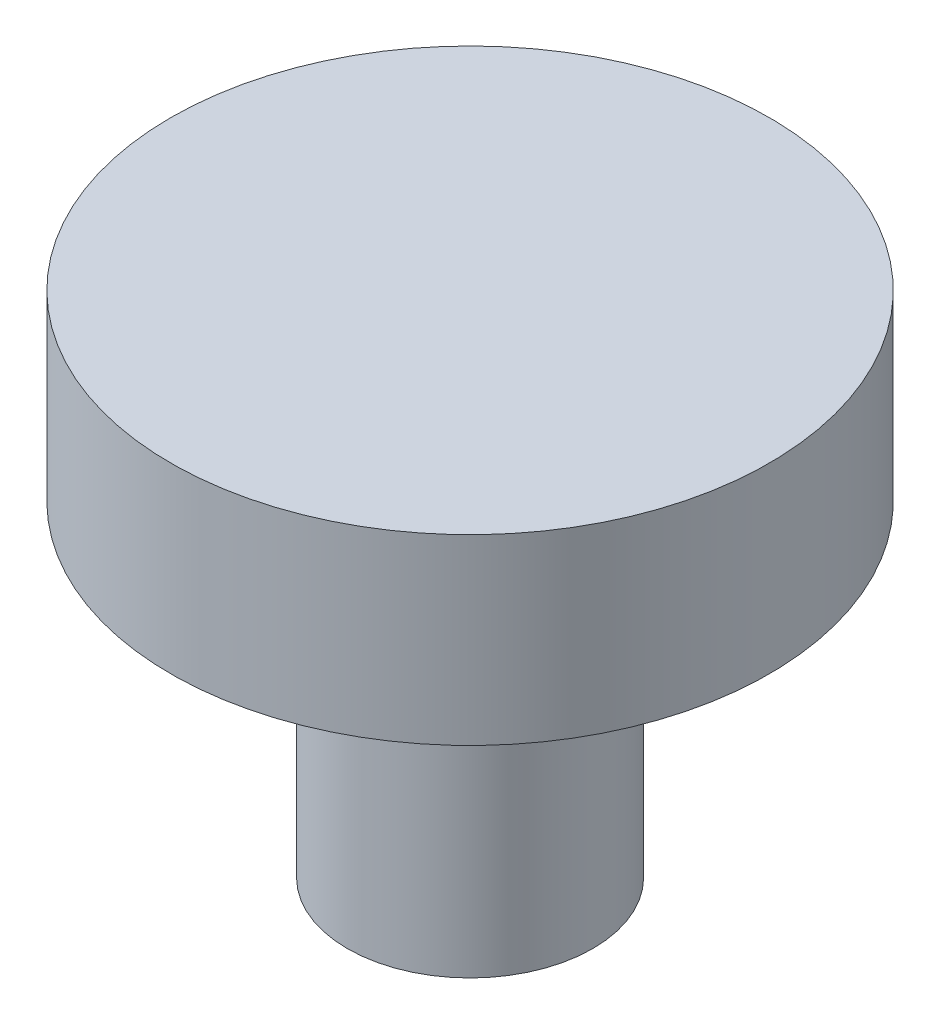
ISO-10303-21;
HEADER;
FILE_DESCRIPTION(('STEP AP214'),'2;1');
FILE_NAME('part.step','',(''),(''),'','','');
FILE_SCHEMA(('AUTOMOTIVE_DESIGN { 1 0 10303 214 1 1 1 1 }'));
ENDSEC;
DATA;
#1=APPLICATION_CONTEXT('core data for automotive mechanical design processes');
#2=APPLICATION_PROTOCOL_DEFINITION('international standard','automotive_design',2000,#1);
#3=PRODUCT_CONTEXT('',#1,'mechanical');
#4=PRODUCT('Part','Part','',(#3));
#5=PRODUCT_RELATED_PRODUCT_CATEGORY('part','',(#4));
#6=PRODUCT_DEFINITION_FORMATION('','',#4);
#7=PRODUCT_DEFINITION_CONTEXT('part definition',#1,'design');
#8=PRODUCT_DEFINITION('design','',#6,#7);
#9=PRODUCT_DEFINITION_SHAPE('','',#8);
#10=(LENGTH_UNIT() NAMED_UNIT(*) SI_UNIT(.MILLI.,.METRE.));
#11=(NAMED_UNIT(*) PLANE_ANGLE_UNIT() SI_UNIT($,.RADIAN.));
#12=(NAMED_UNIT(*) SI_UNIT($,.STERADIAN.) SOLID_ANGLE_UNIT());
#13=UNCERTAINTY_MEASURE_WITH_UNIT(LENGTH_MEASURE(1.E-05),#10,'distance_accuracy_value','');
#14=(GEOMETRIC_REPRESENTATION_CONTEXT(3) GLOBAL_UNCERTAINTY_ASSIGNED_CONTEXT((#13)) GLOBAL_UNIT_ASSIGNED_CONTEXT((#10,
#11,#12)) REPRESENTATION_CONTEXT('',''));
#15=CARTESIAN_POINT('',(0.,0.,0.));
#16=DIRECTION('',(0.,0.,1.));
#17=DIRECTION('',(1.,0.,0.));
#18=AXIS2_PLACEMENT_3D('',#15,#16,#17);
#19=CARTESIAN_POINT('',(0.,0.,0.));
#20=DIRECTION('',(0.,-1.,0.));
#21=DIRECTION('',(1.,0.,0.));
#22=AXIS2_PLACEMENT_3D('',#19,#20,#21);
#23=PLANE('',#22);
#24=CARTESIAN_POINT('',(0.,0.,0.));
#25=DIRECTION('',(0.,1.,0.));
#26=DIRECTION('',(-1.,0.,0.));
#27=AXIS2_PLACEMENT_3D('',#24,#25,#26);
#28=CIRCLE('',#27,5.08);
#29=CARTESIAN_POINT('',(-5.08,0.,0.));
#30=VERTEX_POINT('',#29);
#31=EDGE_CURVE('E10',#30,#30,#28,.T.);
#32=ORIENTED_EDGE('',*,*,#31,.T.);
#33=EDGE_LOOP('',(#32));
#34=FACE_BOUND('',#33,.T.);
#35=ADVANCED_FACE('F33',(#34),#23,.F.);
#36=CARTESIAN_POINT('',(0.,29.8815427403082,0.));
#37=DIRECTION('',(0.,1.,0.));
#38=DIRECTION('',(-1.,0.,0.));
#39=AXIS2_PLACEMENT_3D('',#36,#37,#38);
#40=CYLINDRICAL_SURFACE('',#39,5.08);
#41=ORIENTED_EDGE('',*,*,#31,.F.);
#42=EDGE_LOOP('',(#41));
#43=FACE_BOUND('',#42,.T.);
#44=CARTESIAN_POINT('',(0.,-3.0988,0.));
#45=DIRECTION('',(0.,1.,0.));
#46=DIRECTION('',(-1.,0.,0.));
#47=AXIS2_PLACEMENT_3D('',#44,#45,#46);
#48=CIRCLE('',#47,5.08);
#49=CARTESIAN_POINT('',(-5.08,-3.0988,0.));
#50=VERTEX_POINT('',#49);
#51=EDGE_CURVE('E39',#50,#50,#48,.T.);
#52=ORIENTED_EDGE('',*,*,#51,.T.);
#53=EDGE_LOOP('',(#52));
#54=FACE_BOUND('',#53,.T.);
#55=ADVANCED_FACE('F65',(#43,#54),#40,.T.);
#56=CARTESIAN_POINT('',(5.08,-3.0988,0.));
#57=DIRECTION('',(0.,1.,0.));
#58=DIRECTION('',(-1.,0.,0.));
#59=AXIS2_PLACEMENT_3D('',#56,#57,#58);
#60=PLANE('',#59);
#61=ORIENTED_EDGE('',*,*,#51,.F.);
#62=EDGE_LOOP('',(#61));
#63=FACE_BOUND('',#62,.T.);
#64=CARTESIAN_POINT('',(0.,-3.0988,0.));
#65=DIRECTION('',(0.,1.,0.));
#66=DIRECTION('',(-1.,0.,0.));
#67=AXIS2_PLACEMENT_3D('',#64,#65,#66);
#68=CIRCLE('',#67,2.0828);
#69=CARTESIAN_POINT('',(-2.0828,-3.0988,0.));
#70=VERTEX_POINT('',#69);
#71=EDGE_CURVE('E43',#70,#70,#68,.T.);
#72=ORIENTED_EDGE('',*,*,#71,.T.);
#73=EDGE_LOOP('',(#72));
#74=FACE_BOUND('',#73,.T.);
#75=ADVANCED_FACE('F61',(#63,#74),#60,.F.);
#76=CARTESIAN_POINT('',(0.,29.8815427403082,0.));
#77=DIRECTION('',(0.,1.,0.));
#78=DIRECTION('',(-1.,0.,0.));
#79=AXIS2_PLACEMENT_3D('',#76,#77,#78);
#80=CYLINDRICAL_SURFACE('',#79,2.0828);
#81=ORIENTED_EDGE('',*,*,#71,.F.);
#82=EDGE_LOOP('',(#81));
#83=FACE_BOUND('',#82,.T.);
#84=CARTESIAN_POINT('',(0.,-8.636,0.));
#85=DIRECTION('',(0.,1.,0.));
#86=DIRECTION('',(-1.,0.,0.));
#87=AXIS2_PLACEMENT_3D('',#84,#85,#86);
#88=CIRCLE('',#87,2.0828);
#89=CARTESIAN_POINT('',(-2.0828,-8.636,0.));
#90=VERTEX_POINT('',#89);
#91=EDGE_CURVE('E47',#90,#90,#88,.T.);
#92=ORIENTED_EDGE('',*,*,#91,.T.);
#93=EDGE_LOOP('',(#92));
#94=FACE_BOUND('',#93,.T.);
#95=ADVANCED_FACE('F53',(#83,#94),#80,.T.);
#96=CARTESIAN_POINT('',(2.0828,-8.636,0.));
#97=DIRECTION('',(0.,1.,0.));
#98=DIRECTION('',(-1.,0.,0.));
#99=AXIS2_PLACEMENT_3D('',#96,#97,#98);
#100=PLANE('',#99);
#101=ORIENTED_EDGE('',*,*,#91,.F.);
#102=EDGE_LOOP('',(#101));
#103=FACE_BOUND('',#102,.T.);
#104=ADVANCED_FACE('F55',(#103),#100,.F.);
#105=CLOSED_SHELL('',(#35,#55,#75,#95,#104));
#106=MANIFOLD_SOLID_BREP('B2',#105);
#107=ADVANCED_BREP_SHAPE_REPRESENTATION('',(#18,#106),#14);
#108=SHAPE_DEFINITION_REPRESENTATION(#9,#107);
ENDSEC;
END-ISO-10303-21;
